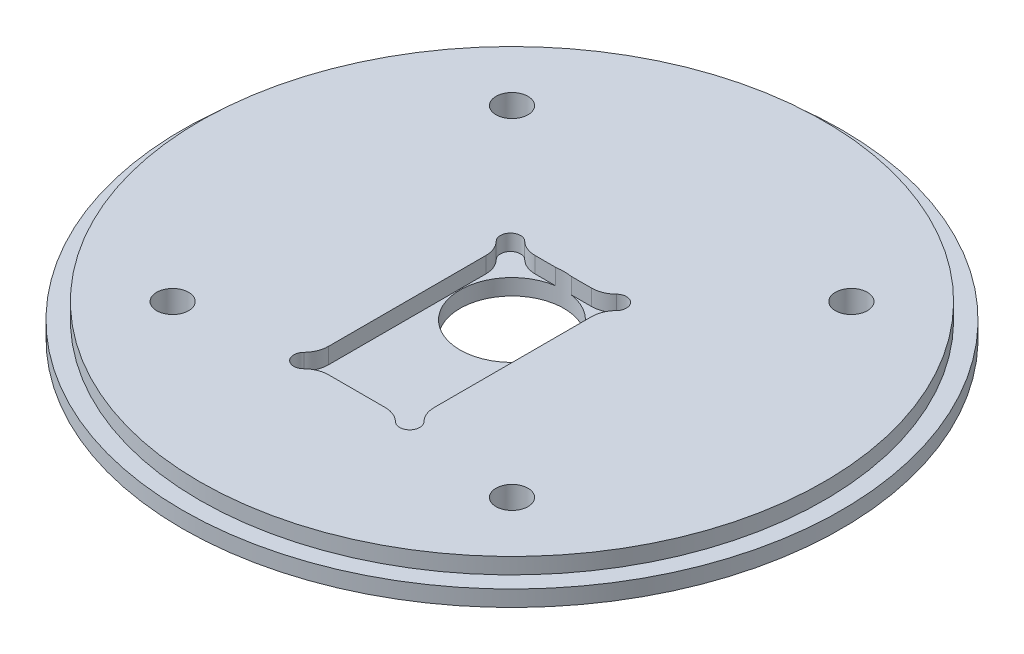
ISO-10303-21;
HEADER;
FILE_DESCRIPTION(('STEP AP214'),'2;1');
FILE_NAME('part.step','',(''),(''),'','','');
FILE_SCHEMA(('AUTOMOTIVE_DESIGN { 1 0 10303 214 1 1 1 1 }'));
ENDSEC;
DATA;
#1=APPLICATION_CONTEXT('core data for automotive mechanical design processes');
#2=APPLICATION_PROTOCOL_DEFINITION('international standard','automotive_design',2000,#1);
#3=PRODUCT_CONTEXT('',#1,'mechanical');
#4=PRODUCT('Part','Part','',(#3));
#5=PRODUCT_RELATED_PRODUCT_CATEGORY('part','',(#4));
#6=PRODUCT_DEFINITION_FORMATION('','',#4);
#7=PRODUCT_DEFINITION_CONTEXT('part definition',#1,'design');
#8=PRODUCT_DEFINITION('design','',#6,#7);
#9=PRODUCT_DEFINITION_SHAPE('','',#8);
#10=(LENGTH_UNIT() NAMED_UNIT(*) SI_UNIT(.MILLI.,.METRE.));
#11=(NAMED_UNIT(*) PLANE_ANGLE_UNIT() SI_UNIT($,.RADIAN.));
#12=(NAMED_UNIT(*) SI_UNIT($,.STERADIAN.) SOLID_ANGLE_UNIT());
#13=UNCERTAINTY_MEASURE_WITH_UNIT(LENGTH_MEASURE(1.E-05),#10,'distance_accuracy_value','');
#14=(GEOMETRIC_REPRESENTATION_CONTEXT(3) GLOBAL_UNCERTAINTY_ASSIGNED_CONTEXT((#13)) GLOBAL_UNIT_ASSIGNED_CONTEXT((#10,
#11,#12)) REPRESENTATION_CONTEXT('',''));
#15=CARTESIAN_POINT('',(0.,0.,0.));
#16=DIRECTION('',(0.,0.,1.));
#17=DIRECTION('',(1.,0.,0.));
#18=AXIS2_PLACEMENT_3D('',#15,#16,#17);
#19=CARTESIAN_POINT('',(-33.6759604540092,6.35,-33.6759604540095));
#20=DIRECTION('',(0.,1.,0.));
#21=DIRECTION('',(0.,0.,1.));
#22=AXIS2_PLACEMENT_3D('',#19,#20,#21);
#23=CYLINDRICAL_SURFACE('',#22,3.175);
#24=CARTESIAN_POINT('',(-33.6759604540092,6.35,-33.6759604540095));
#25=DIRECTION('',(0.,1.,0.));
#26=DIRECTION('',(0.,0.,1.));
#27=AXIS2_PLACEMENT_3D('',#24,#25,#26);
#28=CIRCLE('',#27,3.175);
#29=CARTESIAN_POINT('',(-33.6759604540092,6.35,-30.5009604540095));
#30=VERTEX_POINT('',#29);
#31=EDGE_CURVE('E320',#30,#30,#28,.T.);
#32=ORIENTED_EDGE('',*,*,#31,.T.);
#33=EDGE_LOOP('',(#32));
#34=FACE_BOUND('',#33,.T.);
#35=CARTESIAN_POINT('',(-33.6759604540092,1.5875,-33.6759604540095));
#36=DIRECTION('',(0.,-1.,0.));
#37=DIRECTION('',(0.,0.,-1.));
#38=AXIS2_PLACEMENT_3D('',#35,#36,#37);
#39=CIRCLE('',#38,3.175);
#40=CARTESIAN_POINT('',(-33.6759604540092,1.5875,-36.8509604540095));
#41=VERTEX_POINT('',#40);
#42=EDGE_CURVE('E43',#41,#41,#39,.F.);
#43=ORIENTED_EDGE('',*,*,#42,.F.);
#44=EDGE_LOOP('',(#43));
#45=FACE_BOUND('',#44,.T.);
#46=ADVANCED_FACE('F39',(#34,#45),#23,.F.);
#47=CARTESIAN_POINT('',(33.6759604540091,6.35,33.6759604540095));
#48=DIRECTION('',(0.,1.,0.));
#49=DIRECTION('',(0.,0.,1.));
#50=AXIS2_PLACEMENT_3D('',#47,#48,#49);
#51=CYLINDRICAL_SURFACE('',#50,3.175);
#52=CARTESIAN_POINT('',(33.6759604540091,6.35,33.6759604540095));
#53=DIRECTION('',(0.,1.,0.));
#54=DIRECTION('',(0.,0.,1.));
#55=AXIS2_PLACEMENT_3D('',#52,#53,#54);
#56=CIRCLE('',#55,3.175);
#57=CARTESIAN_POINT('',(33.6759604540091,6.35,36.8509604540095));
#58=VERTEX_POINT('',#57);
#59=EDGE_CURVE('E317',#58,#58,#56,.T.);
#60=ORIENTED_EDGE('',*,*,#59,.T.);
#61=EDGE_LOOP('',(#60));
#62=FACE_BOUND('',#61,.T.);
#63=CARTESIAN_POINT('',(33.6759604540091,1.5875,33.6759604540095));
#64=DIRECTION('',(0.,-1.,0.));
#65=DIRECTION('',(0.,0.,-1.));
#66=AXIS2_PLACEMENT_3D('',#63,#64,#65);
#67=CIRCLE('',#66,3.175);
#68=CARTESIAN_POINT('',(33.6759604540091,1.5875,30.5009604540095));
#69=VERTEX_POINT('',#68);
#70=EDGE_CURVE('E344',#69,#69,#67,.F.);
#71=ORIENTED_EDGE('',*,*,#70,.F.);
#72=EDGE_LOOP('',(#71));
#73=FACE_BOUND('',#72,.T.);
#74=ADVANCED_FACE('F354',(#62,#73),#51,.F.);
#75=CARTESIAN_POINT('',(33.6759604540095,6.35,-33.6759604540092));
#76=DIRECTION('',(0.,1.,0.));
#77=DIRECTION('',(0.,0.,1.));
#78=AXIS2_PLACEMENT_3D('',#75,#76,#77);
#79=CYLINDRICAL_SURFACE('',#78,3.175);
#80=CARTESIAN_POINT('',(33.6759604540095,6.35,-33.6759604540092));
#81=DIRECTION('',(0.,1.,0.));
#82=DIRECTION('',(0.,0.,1.));
#83=AXIS2_PLACEMENT_3D('',#80,#81,#82);
#84=CIRCLE('',#83,3.175);
#85=CARTESIAN_POINT('',(33.6759604540095,6.35,-30.5009604540092));
#86=VERTEX_POINT('',#85);
#87=EDGE_CURVE('E314',#86,#86,#84,.T.);
#88=ORIENTED_EDGE('',*,*,#87,.T.);
#89=EDGE_LOOP('',(#88));
#90=FACE_BOUND('',#89,.T.);
#91=CARTESIAN_POINT('',(33.6759604540095,1.5875,-33.6759604540092));
#92=DIRECTION('',(0.,-1.,0.));
#93=DIRECTION('',(0.,0.,-1.));
#94=AXIS2_PLACEMENT_3D('',#91,#92,#93);
#95=CIRCLE('',#94,3.175);
#96=CARTESIAN_POINT('',(33.6759604540095,1.5875,-36.8509604540092));
#97=VERTEX_POINT('',#96);
#98=EDGE_CURVE('E341',#97,#97,#95,.F.);
#99=ORIENTED_EDGE('',*,*,#98,.F.);
#100=EDGE_LOOP('',(#99));
#101=FACE_BOUND('',#100,.T.);
#102=ADVANCED_FACE('F361',(#90,#101),#79,.F.);
#103=CARTESIAN_POINT('',(-33.6759604540095,6.35,33.6759604540092));
#104=DIRECTION('',(0.,1.,0.));
#105=DIRECTION('',(0.,0.,1.));
#106=AXIS2_PLACEMENT_3D('',#103,#104,#105);
#107=CYLINDRICAL_SURFACE('',#106,3.175);
#108=CARTESIAN_POINT('',(-33.6759604540095,6.35,33.6759604540092));
#109=DIRECTION('',(0.,1.,0.));
#110=DIRECTION('',(0.,0.,1.));
#111=AXIS2_PLACEMENT_3D('',#108,#109,#110);
#112=CIRCLE('',#111,3.175);
#113=CARTESIAN_POINT('',(-33.6759604540095,6.35,36.8509604540092));
#114=VERTEX_POINT('',#113);
#115=EDGE_CURVE('E311',#114,#114,#112,.T.);
#116=ORIENTED_EDGE('',*,*,#115,.T.);
#117=EDGE_LOOP('',(#116));
#118=FACE_BOUND('',#117,.T.);
#119=CARTESIAN_POINT('',(-33.6759604540095,1.5875,33.6759604540092));
#120=DIRECTION('',(0.,-1.,0.));
#121=DIRECTION('',(0.,0.,-1.));
#122=AXIS2_PLACEMENT_3D('',#119,#120,#121);
#123=CIRCLE('',#122,3.175);
#124=CARTESIAN_POINT('',(-33.6759604540095,1.5875,30.5009604540092));
#125=VERTEX_POINT('',#124);
#126=EDGE_CURVE('E338',#125,#125,#123,.F.);
#127=ORIENTED_EDGE('',*,*,#126,.F.);
#128=EDGE_LOOP('',(#127));
#129=FACE_BOUND('',#128,.T.);
#130=ADVANCED_FACE('F386',(#118,#129),#107,.F.);
#131=CARTESIAN_POINT('',(0.,6.35,0.));
#132=DIRECTION('',(0.,-1.,0.));
#133=DIRECTION('',(0.,0.,-1.));
#134=AXIS2_PLACEMENT_3D('',#131,#132,#133);
#135=CYLINDRICAL_SURFACE('',#134,65.405);
#136=CARTESIAN_POINT('',(0.,0.,0.));
#137=DIRECTION('',(0.,1.,0.));
#138=DIRECTION('',(0.,0.,1.));
#139=AXIS2_PLACEMENT_3D('',#136,#137,#138);
#140=CIRCLE('',#139,65.405);
#141=CARTESIAN_POINT('',(0.,0.,65.405));
#142=VERTEX_POINT('',#141);
#143=EDGE_CURVE('E332',#142,#142,#140,.T.);
#144=ORIENTED_EDGE('',*,*,#143,.T.);
#145=EDGE_LOOP('',(#144));
#146=FACE_BOUND('',#145,.T.);
#147=CARTESIAN_POINT('',(0.,3.175,0.));
#148=DIRECTION('',(0.,1.,0.));
#149=DIRECTION('',(0.,0.,1.));
#150=AXIS2_PLACEMENT_3D('',#147,#148,#149);
#151=CIRCLE('',#150,65.405);
#152=CARTESIAN_POINT('',(0.,3.175,65.405));
#153=VERTEX_POINT('',#152);
#154=EDGE_CURVE('E327',#153,#153,#151,.T.);
#155=ORIENTED_EDGE('',*,*,#154,.F.);
#156=EDGE_LOOP('',(#155));
#157=FACE_BOUND('',#156,.T.);
#158=ADVANCED_FACE('F41',(#146,#157),#135,.T.);
#159=CARTESIAN_POINT('',(0.,0.,0.));
#160=DIRECTION('',(0.,1.,0.));
#161=DIRECTION('',(0.,0.,1.));
#162=AXIS2_PLACEMENT_3D('',#159,#160,#161);
#163=PLANE('',#162);
#164=CARTESIAN_POINT('',(-33.6759604540092,0.,-33.6759604540095));
#165=DIRECTION('',(0.,-1.,0.));
#166=DIRECTION('',(0.,0.,-1.));
#167=AXIS2_PLACEMENT_3D('',#164,#165,#166);
#168=CIRCLE('',#167,6.0325);
#169=CARTESIAN_POINT('',(-33.6759604540092,0.,-39.7084604540095));
#170=VERTEX_POINT('',#169);
#171=EDGE_CURVE('E391',#170,#170,#168,.T.);
#172=ORIENTED_EDGE('',*,*,#171,.F.);
#173=EDGE_LOOP('',(#172));
#174=FACE_BOUND('',#173,.T.);
#175=CARTESIAN_POINT('',(33.6759604540095,0.,-33.6759604540092));
#176=DIRECTION('',(0.,-1.,0.));
#177=DIRECTION('',(0.,0.,-1.));
#178=AXIS2_PLACEMENT_3D('',#175,#176,#177);
#179=CIRCLE('',#178,6.0325);
#180=CARTESIAN_POINT('',(33.6759604540095,0.,-39.7084604540092));
#181=VERTEX_POINT('',#180);
#182=EDGE_CURVE('E395',#181,#181,#179,.T.);
#183=ORIENTED_EDGE('',*,*,#182,.F.);
#184=EDGE_LOOP('',(#183));
#185=FACE_BOUND('',#184,.T.);
#186=CARTESIAN_POINT('',(33.6759604540091,0.,33.6759604540095));
#187=DIRECTION('',(0.,-1.,0.));
#188=DIRECTION('',(0.,0.,-1.));
#189=AXIS2_PLACEMENT_3D('',#186,#187,#188);
#190=CIRCLE('',#189,6.03249999999999);
#191=CARTESIAN_POINT('',(33.6759604540091,0.,27.6434604540095));
#192=VERTEX_POINT('',#191);
#193=EDGE_CURVE('E399',#192,#192,#190,.T.);
#194=ORIENTED_EDGE('',*,*,#193,.F.);
#195=EDGE_LOOP('',(#194));
#196=FACE_BOUND('',#195,.T.);
#197=CARTESIAN_POINT('',(-33.6759604540095,0.,33.6759604540092));
#198=DIRECTION('',(0.,-1.,0.));
#199=DIRECTION('',(0.,0.,-1.));
#200=AXIS2_PLACEMENT_3D('',#197,#198,#199);
#201=CIRCLE('',#200,6.0325);
#202=CARTESIAN_POINT('',(-33.6759604540095,0.,27.6434604540092));
#203=VERTEX_POINT('',#202);
#204=EDGE_CURVE('E196',#203,#203,#201,.T.);
#205=ORIENTED_EDGE('',*,*,#204,.F.);
#206=EDGE_LOOP('',(#205));
#207=FACE_BOUND('',#206,.T.);
#208=CARTESIAN_POINT('',(0.,0.,0.));
#209=DIRECTION('',(0.,1.,0.));
#210=DIRECTION('',(0.,0.,1.));
#211=AXIS2_PLACEMENT_3D('',#208,#209,#210);
#212=CIRCLE('',#211,10.31875);
#213=CARTESIAN_POINT('',(0.,0.,10.31875));
#214=VERTEX_POINT('',#213);
#215=EDGE_CURVE('E308',#214,#214,#212,.T.);
#216=ORIENTED_EDGE('',*,*,#215,.T.);
#217=EDGE_LOOP('',(#216));
#218=FACE_BOUND('',#217,.T.);
#219=ORIENTED_EDGE('',*,*,#143,.F.);
#220=EDGE_LOOP('',(#219));
#221=FACE_BOUND('',#220,.T.);
#222=ADVANCED_FACE('F374',(#174,#185,#196,#207,#218,#221),#163,.F.);
#223=CARTESIAN_POINT('',(0.,3.175,0.));
#224=DIRECTION('',(0.,1.,0.));
#225=DIRECTION('',(0.,0.,1.));
#226=AXIS2_PLACEMENT_3D('',#223,#224,#225);
#227=PLANE('',#226);
#228=CARTESIAN_POINT('',(0.,3.175,0.));
#229=DIRECTION('',(0.,1.,0.));
#230=DIRECTION('',(0.,0.,1.));
#231=AXIS2_PLACEMENT_3D('',#228,#229,#230);
#232=CIRCLE('',#231,61.976);
#233=CARTESIAN_POINT('',(0.,3.175,61.976));
#234=VERTEX_POINT('',#233);
#235=EDGE_CURVE('E324',#234,#234,#232,.T.);
#236=ORIENTED_EDGE('',*,*,#235,.F.);
#237=EDGE_LOOP('',(#236));
#238=FACE_BOUND('',#237,.T.);
#239=ORIENTED_EDGE('',*,*,#154,.T.);
#240=EDGE_LOOP('',(#239));
#241=FACE_BOUND('',#240,.T.);
#242=ADVANCED_FACE('F370',(#238,#241),#227,.T.);
#243=CARTESIAN_POINT('',(0.,3.175,0.));
#244=DIRECTION('',(0.,1.,0.));
#245=DIRECTION('',(0.,0.,1.));
#246=AXIS2_PLACEMENT_3D('',#243,#244,#245);
#247=CYLINDRICAL_SURFACE('',#246,61.976);
#248=ORIENTED_EDGE('',*,*,#235,.T.);
#249=EDGE_LOOP('',(#248));
#250=FACE_BOUND('',#249,.T.);
#251=CARTESIAN_POINT('',(0.,6.35,0.));
#252=DIRECTION('',(0.,1.,0.));
#253=DIRECTION('',(0.,0.,1.));
#254=AXIS2_PLACEMENT_3D('',#251,#252,#253);
#255=CIRCLE('',#254,61.976);
#256=CARTESIAN_POINT('',(0.,6.35,61.976));
#257=VERTEX_POINT('',#256);
#258=EDGE_CURVE('E323',#257,#257,#255,.T.);
#259=ORIENTED_EDGE('',*,*,#258,.F.);
#260=EDGE_LOOP('',(#259));
#261=FACE_BOUND('',#260,.T.);
#262=ADVANCED_FACE('F366',(#250,#261),#247,.T.);
#263=CARTESIAN_POINT('',(0.,6.35,0.));
#264=DIRECTION('',(0.,1.,0.));
#265=DIRECTION('',(0.,0.,1.));
#266=AXIS2_PLACEMENT_3D('',#263,#264,#265);
#267=PLANE('',#266);
#268=DIRECTION('',(-1.,0.,0.));
#269=VECTOR('',#268,1.);
#270=CARTESIAN_POINT('',(-5.60102051443364,6.35,-10.2));
#271=LINE('',#270,#269);
#272=CARTESIAN_POINT('',(-1.56096174280472,6.35,-10.2));
#273=VERTEX_POINT('',#272);
#274=CARTESIAN_POINT('',(-5.60102051443364,6.35,-10.2));
#275=VERTEX_POINT('',#274);
#276=EDGE_CURVE('E264',#273,#275,#271,.T.);
#277=ORIENTED_EDGE('',*,*,#276,.F.);
#278=CARTESIAN_POINT('',(0.,6.35,0.));
#279=DIRECTION('',(0.,1.,0.));
#280=DIRECTION('',(0.,0.,1.));
#281=AXIS2_PLACEMENT_3D('',#278,#279,#280);
#282=CIRCLE('',#281,10.31875);
#283=CARTESIAN_POINT('',(1.56096174280472,6.35,-10.2));
#284=VERTEX_POINT('',#283);
#285=EDGE_CURVE('E277',#284,#273,#282,.T.);
#286=ORIENTED_EDGE('',*,*,#285,.F.);
#287=CARTESIAN_POINT('',(5.60102051443364,6.35,-10.2));
#288=VERTEX_POINT('',#287);
#289=EDGE_CURVE('E265',#288,#284,#271,.T.);
#290=ORIENTED_EDGE('',*,*,#289,.F.);
#291=CARTESIAN_POINT('',(5.60102051443364,6.35,-15.2));
#292=DIRECTION('',(0.,-1.,0.));
#293=DIRECTION('',(0.,0.,-1.));
#294=AXIS2_PLACEMENT_3D('',#291,#292,#293);
#295=CIRCLE('',#294,5.);
#296=CARTESIAN_POINT('',(9.10029157555247,6.35,-11.6285714285714));
#297=VERTEX_POINT('',#296);
#298=EDGE_CURVE('E261',#297,#288,#295,.T.);
#299=ORIENTED_EDGE('',*,*,#298,.F.);
#300=CARTESIAN_POINT('',(10.5,6.35,-10.2));
#301=DIRECTION('',(0.,1.,0.));
#302=DIRECTION('',(0.,0.,1.));
#303=AXIS2_PLACEMENT_3D('',#300,#301,#302);
#304=CIRCLE('',#303,2.);
#305=CARTESIAN_POINT('',(11.9285714285714,6.35,-8.80029157555247));
#306=VERTEX_POINT('',#305);
#307=EDGE_CURVE('E258',#306,#297,#304,.T.);
#308=ORIENTED_EDGE('',*,*,#307,.F.);
#309=CARTESIAN_POINT('',(15.5,6.35,-5.30102051443365));
#310=DIRECTION('',(0.,-1.,0.));
#311=DIRECTION('',(0.,0.,1.));
#312=AXIS2_PLACEMENT_3D('',#309,#310,#311);
#313=CIRCLE('',#312,5.);
#314=CARTESIAN_POINT('',(10.5,6.35,-5.30102051443365));
#315=VERTEX_POINT('',#314);
#316=EDGE_CURVE('E255',#315,#306,#313,.T.);
#317=ORIENTED_EDGE('',*,*,#316,.F.);
#318=DIRECTION('',(0.,0.,-1.));
#319=VECTOR('',#318,1.);
#320=CARTESIAN_POINT('',(10.5,6.35,-5.30102051443365));
#321=LINE('',#320,#319);
#322=CARTESIAN_POINT('',(10.5,6.35,25.9010205144336));
#323=VERTEX_POINT('',#322);
#324=EDGE_CURVE('E252',#323,#315,#321,.T.);
#325=ORIENTED_EDGE('',*,*,#324,.F.);
#326=CARTESIAN_POINT('',(15.5,6.35,25.9010205144336));
#327=DIRECTION('',(0.,-1.,0.));
#328=DIRECTION('',(0.,0.,-1.));
#329=AXIS2_PLACEMENT_3D('',#326,#327,#328);
#330=CIRCLE('',#329,5.);
#331=CARTESIAN_POINT('',(11.9285714285714,6.35,29.4002915755525));
#332=VERTEX_POINT('',#331);
#333=EDGE_CURVE('E249',#332,#323,#330,.T.);
#334=ORIENTED_EDGE('',*,*,#333,.F.);
#335=CARTESIAN_POINT('',(10.5,6.35,30.8));
#336=DIRECTION('',(0.,1.,0.));
#337=DIRECTION('',(0.,0.,-1.));
#338=AXIS2_PLACEMENT_3D('',#335,#336,#337);
#339=CIRCLE('',#338,2.);
#340=CARTESIAN_POINT('',(9.10029157555247,6.35,32.2285714285714));
#341=VERTEX_POINT('',#340);
#342=EDGE_CURVE('E246',#341,#332,#339,.T.);
#343=ORIENTED_EDGE('',*,*,#342,.F.);
#344=CARTESIAN_POINT('',(5.60102051443364,6.35,35.8));
#345=DIRECTION('',(0.,-1.,0.));
#346=DIRECTION('',(0.,0.,1.));
#347=AXIS2_PLACEMENT_3D('',#344,#345,#346);
#348=CIRCLE('',#347,5.);
#349=CARTESIAN_POINT('',(5.60102051443364,6.35,30.8));
#350=VERTEX_POINT('',#349);
#351=EDGE_CURVE('E243',#350,#341,#348,.T.);
#352=ORIENTED_EDGE('',*,*,#351,.F.);
#353=DIRECTION('',(1.,0.,0.));
#354=VECTOR('',#353,1.);
#355=CARTESIAN_POINT('',(-5.60102051443364,6.35,30.8));
#356=LINE('',#355,#354);
#357=CARTESIAN_POINT('',(-5.60102051443364,6.35,30.8));
#358=VERTEX_POINT('',#357);
#359=EDGE_CURVE('E240',#358,#350,#356,.T.);
#360=ORIENTED_EDGE('',*,*,#359,.F.);
#361=CARTESIAN_POINT('',(-5.60102051443364,6.35,35.8));
#362=DIRECTION('',(0.,-1.,0.));
#363=DIRECTION('',(0.,0.,-1.));
#364=AXIS2_PLACEMENT_3D('',#361,#362,#363);
#365=CIRCLE('',#364,5.);
#366=CARTESIAN_POINT('',(-9.10029157555246,6.35,32.2285714285714));
#367=VERTEX_POINT('',#366);
#368=EDGE_CURVE('E237',#367,#358,#365,.T.);
#369=ORIENTED_EDGE('',*,*,#368,.F.);
#370=CARTESIAN_POINT('',(-10.5,6.35,30.8));
#371=DIRECTION('',(0.,1.,0.));
#372=DIRECTION('',(0.,0.,1.));
#373=AXIS2_PLACEMENT_3D('',#370,#371,#372);
#374=CIRCLE('',#373,2.);
#375=CARTESIAN_POINT('',(-11.9285714285714,6.35,29.4002915755525));
#376=VERTEX_POINT('',#375);
#377=EDGE_CURVE('E235',#376,#367,#374,.T.);
#378=ORIENTED_EDGE('',*,*,#377,.F.);
#379=CARTESIAN_POINT('',(-15.5,6.35,25.9010205144336));
#380=DIRECTION('',(0.,-1.,0.));
#381=DIRECTION('',(0.,0.,1.));
#382=AXIS2_PLACEMENT_3D('',#379,#380,#381);
#383=CIRCLE('',#382,5.);
#384=CARTESIAN_POINT('',(-10.5,6.35,25.9010205144336));
#385=VERTEX_POINT('',#384);
#386=EDGE_CURVE('E173',#385,#376,#383,.T.);
#387=ORIENTED_EDGE('',*,*,#386,.F.);
#388=DIRECTION('',(0.,0.,1.));
#389=VECTOR('',#388,1.);
#390=CARTESIAN_POINT('',(-10.5,6.35,-5.30102051443365));
#391=LINE('',#390,#389);
#392=CARTESIAN_POINT('',(-10.5,6.35,-5.30102051443365));
#393=VERTEX_POINT('',#392);
#394=EDGE_CURVE('E190',#393,#385,#391,.T.);
#395=ORIENTED_EDGE('',*,*,#394,.F.);
#396=CARTESIAN_POINT('',(-15.5,6.35,-5.30102051443365));
#397=DIRECTION('',(0.,-1.,0.));
#398=DIRECTION('',(0.,0.,-1.));
#399=AXIS2_PLACEMENT_3D('',#396,#397,#398);
#400=CIRCLE('',#399,5.);
#401=CARTESIAN_POINT('',(-11.9285714285714,6.35,-8.80029157555247));
#402=VERTEX_POINT('',#401);
#403=EDGE_CURVE('E193',#402,#393,#400,.T.);
#404=ORIENTED_EDGE('',*,*,#403,.F.);
#405=CARTESIAN_POINT('',(-10.5,6.35,-10.2));
#406=DIRECTION('',(0.,1.,0.));
#407=DIRECTION('',(0.,0.,-1.));
#408=AXIS2_PLACEMENT_3D('',#405,#406,#407);
#409=CIRCLE('',#408,2.);
#410=CARTESIAN_POINT('',(-9.10029157555247,6.35,-11.6285714285714));
#411=VERTEX_POINT('',#410);
#412=EDGE_CURVE('E270',#411,#402,#409,.T.);
#413=ORIENTED_EDGE('',*,*,#412,.F.);
#414=CARTESIAN_POINT('',(-5.60102051443364,6.35,-15.2));
#415=DIRECTION('',(0.,-1.,0.));
#416=DIRECTION('',(0.,0.,1.));
#417=AXIS2_PLACEMENT_3D('',#414,#415,#416);
#418=CIRCLE('',#417,5.);
#419=EDGE_CURVE('E267',#275,#411,#418,.T.);
#420=ORIENTED_EDGE('',*,*,#419,.F.);
#421=EDGE_LOOP('',(#277,#286,#290,#299,#308,#317,#325,#334,#343,#352,#360,#369,#378,#387,#395,
#404,#413,#420));
#422=FACE_BOUND('',#421,.T.);
#423=ORIENTED_EDGE('',*,*,#115,.F.);
#424=EDGE_LOOP('',(#423));
#425=FACE_BOUND('',#424,.T.);
#426=ORIENTED_EDGE('',*,*,#87,.F.);
#427=EDGE_LOOP('',(#426));
#428=FACE_BOUND('',#427,.T.);
#429=ORIENTED_EDGE('',*,*,#59,.F.);
#430=EDGE_LOOP('',(#429));
#431=FACE_BOUND('',#430,.T.);
#432=ORIENTED_EDGE('',*,*,#31,.F.);
#433=EDGE_LOOP('',(#432));
#434=FACE_BOUND('',#433,.T.);
#435=ORIENTED_EDGE('',*,*,#258,.T.);
#436=EDGE_LOOP('',(#435));
#437=FACE_BOUND('',#436,.T.);
#438=ADVANCED_FACE('F369',(#422,#425,#428,#431,#434,#437),#267,.T.);
#439=CARTESIAN_POINT('',(0.,6.35,0.));
#440=DIRECTION('',(0.,1.,0.));
#441=DIRECTION('',(0.,0.,1.));
#442=AXIS2_PLACEMENT_3D('',#439,#440,#441);
#443=CYLINDRICAL_SURFACE('',#442,10.31875);
#444=ORIENTED_EDGE('',*,*,#285,.T.);
#445=DIRECTION('',(0.,1.,0.));
#446=VECTOR('',#445,1.);
#447=CARTESIAN_POINT('',(-1.56096174280472,6.35,-10.2));
#448=LINE('',#447,#446);
#449=CARTESIAN_POINT('',(-1.56096174280472,3.175,-10.2));
#450=VERTEX_POINT('',#449);
#451=EDGE_CURVE('E11',#273,#450,#448,.F.);
#452=ORIENTED_EDGE('',*,*,#451,.T.);
#453=CARTESIAN_POINT('',(0.,3.175,0.));
#454=DIRECTION('',(0.,1.,0.));
#455=DIRECTION('',(0.,0.,1.));
#456=AXIS2_PLACEMENT_3D('',#453,#454,#455);
#457=CIRCLE('',#456,10.31875);
#458=CARTESIAN_POINT('',(1.56096174280472,3.175,-10.2));
#459=VERTEX_POINT('',#458);
#460=EDGE_CURVE('E61',#459,#450,#457,.F.);
#461=ORIENTED_EDGE('',*,*,#460,.F.);
#462=DIRECTION('',(0.,1.,0.));
#463=VECTOR('',#462,1.);
#464=CARTESIAN_POINT('',(1.56096174280472,6.35,-10.2));
#465=LINE('',#464,#463);
#466=EDGE_CURVE('E48',#459,#284,#465,.T.);
#467=ORIENTED_EDGE('',*,*,#466,.T.);
#468=EDGE_LOOP('',(#444,#452,#461,#467));
#469=FACE_BOUND('',#468,.T.);
#470=ORIENTED_EDGE('',*,*,#215,.F.);
#471=EDGE_LOOP('',(#470));
#472=FACE_BOUND('',#471,.T.);
#473=ADVANCED_FACE('F377',(#469,#472),#443,.F.);
#474=CARTESIAN_POINT('',(-5.60102051443364,3.175,-10.2));
#475=DIRECTION('',(0.,0.,-1.));
#476=DIRECTION('',(-1.,0.,0.));
#477=AXIS2_PLACEMENT_3D('',#474,#475,#476);
#478=PLANE('',#477);
#479=ORIENTED_EDGE('',*,*,#276,.T.);
#480=DIRECTION('',(0.,1.,0.));
#481=VECTOR('',#480,1.);
#482=CARTESIAN_POINT('',(-5.60102051443364,3.175,-10.2));
#483=LINE('',#482,#481);
#484=CARTESIAN_POINT('',(-5.60102051443364,3.175,-10.2));
#485=VERTEX_POINT('',#484);
#486=EDGE_CURVE('E284',#485,#275,#483,.T.);
#487=ORIENTED_EDGE('',*,*,#486,.F.);
#488=DIRECTION('',(-1.,0.,0.));
#489=VECTOR('',#488,1.);
#490=CARTESIAN_POINT('',(-5.60102051443364,3.175,-10.2));
#491=LINE('',#490,#489);
#492=EDGE_CURVE('E223',#450,#485,#491,.T.);
#493=ORIENTED_EDGE('',*,*,#492,.F.);
#494=ORIENTED_EDGE('',*,*,#451,.F.);
#495=EDGE_LOOP('',(#479,#487,#493,#494));
#496=FACE_BOUND('',#495,.T.);
#497=ADVANCED_FACE('F411',(#496),#478,.F.);
#498=CARTESIAN_POINT('',(5.60102051443364,3.175,-10.2));
#499=VERTEX_POINT('',#498);
#500=EDGE_CURVE('E56',#499,#459,#491,.T.);
#501=ORIENTED_EDGE('',*,*,#500,.F.);
#502=DIRECTION('',(0.,1.,0.));
#503=VECTOR('',#502,1.);
#504=CARTESIAN_POINT('',(5.60102051443364,3.175,-10.2));
#505=LINE('',#504,#503);
#506=EDGE_CURVE('E287',#499,#288,#505,.T.);
#507=ORIENTED_EDGE('',*,*,#506,.T.);
#508=ORIENTED_EDGE('',*,*,#289,.T.);
#509=ORIENTED_EDGE('',*,*,#466,.F.);
#510=EDGE_LOOP('',(#501,#507,#508,#509));
#511=FACE_BOUND('',#510,.T.);
#512=ADVANCED_FACE('F417',(#511),#478,.F.);
#513=CARTESIAN_POINT('',(-15.5,3.175,25.9010205144336));
#514=DIRECTION('',(0.,1.,0.));
#515=DIRECTION('',(0.,0.,1.));
#516=AXIS2_PLACEMENT_3D('',#513,#514,#515);
#517=PLANE('',#516);
#518=ORIENTED_EDGE('',*,*,#460,.T.);
#519=ORIENTED_EDGE('',*,*,#492,.T.);
#520=CARTESIAN_POINT('',(-5.60102051443364,3.175,-15.2));
#521=DIRECTION('',(0.,-1.,0.));
#522=DIRECTION('',(0.,0.,1.));
#523=AXIS2_PLACEMENT_3D('',#520,#521,#522);
#524=CIRCLE('',#523,5.);
#525=CARTESIAN_POINT('',(-9.10029157555247,3.175,-11.6285714285714));
#526=VERTEX_POINT('',#525);
#527=EDGE_CURVE('E225',#485,#526,#524,.T.);
#528=ORIENTED_EDGE('',*,*,#527,.T.);
#529=CARTESIAN_POINT('',(-10.5,3.175,-10.2));
#530=DIRECTION('',(0.,1.,0.));
#531=DIRECTION('',(0.,0.,-1.));
#532=AXIS2_PLACEMENT_3D('',#529,#530,#531);
#533=CIRCLE('',#532,2.);
#534=CARTESIAN_POINT('',(-11.9285714285714,3.175,-8.80029157555247));
#535=VERTEX_POINT('',#534);
#536=EDGE_CURVE('E228',#526,#535,#533,.T.);
#537=ORIENTED_EDGE('',*,*,#536,.T.);
#538=CARTESIAN_POINT('',(-15.5,3.175,-5.30102051443365));
#539=DIRECTION('',(0.,-1.,0.));
#540=DIRECTION('',(0.,0.,-1.));
#541=AXIS2_PLACEMENT_3D('',#538,#539,#540);
#542=CIRCLE('',#541,5.);
#543=CARTESIAN_POINT('',(-10.5,3.175,-5.30102051443365));
#544=VERTEX_POINT('',#543);
#545=EDGE_CURVE('E231',#535,#544,#542,.T.);
#546=ORIENTED_EDGE('',*,*,#545,.T.);
#547=DIRECTION('',(0.,0.,1.));
#548=VECTOR('',#547,1.);
#549=CARTESIAN_POINT('',(-10.5,3.175,-5.30102051443365));
#550=LINE('',#549,#548);
#551=CARTESIAN_POINT('',(-10.5,3.175,25.9010205144336));
#552=VERTEX_POINT('',#551);
#553=EDGE_CURVE('E178',#544,#552,#550,.T.);
#554=ORIENTED_EDGE('',*,*,#553,.T.);
#555=CARTESIAN_POINT('',(-15.5,3.175,25.9010205144336));
#556=DIRECTION('',(0.,-1.,0.));
#557=DIRECTION('',(0.,0.,1.));
#558=AXIS2_PLACEMENT_3D('',#555,#556,#557);
#559=CIRCLE('',#558,5.);
#560=CARTESIAN_POINT('',(-11.9285714285714,3.175,29.4002915755525));
#561=VERTEX_POINT('',#560);
#562=EDGE_CURVE('E170',#552,#561,#559,.T.);
#563=ORIENTED_EDGE('',*,*,#562,.T.);
#564=CARTESIAN_POINT('',(-10.5,3.175,30.8));
#565=DIRECTION('',(0.,1.,0.));
#566=DIRECTION('',(0.,0.,1.));
#567=AXIS2_PLACEMENT_3D('',#564,#565,#566);
#568=CIRCLE('',#567,2.);
#569=CARTESIAN_POINT('',(-9.10029157555246,3.175,32.2285714285714));
#570=VERTEX_POINT('',#569);
#571=EDGE_CURVE('E181',#561,#570,#568,.T.);
#572=ORIENTED_EDGE('',*,*,#571,.T.);
#573=CARTESIAN_POINT('',(-5.60102051443364,3.175,35.8));
#574=DIRECTION('',(0.,-1.,0.));
#575=DIRECTION('',(0.,0.,-1.));
#576=AXIS2_PLACEMENT_3D('',#573,#574,#575);
#577=CIRCLE('',#576,5.);
#578=CARTESIAN_POINT('',(-5.60102051443364,3.175,30.8));
#579=VERTEX_POINT('',#578);
#580=EDGE_CURVE('E185',#570,#579,#577,.T.);
#581=ORIENTED_EDGE('',*,*,#580,.T.);
#582=DIRECTION('',(1.,0.,0.));
#583=VECTOR('',#582,1.);
#584=CARTESIAN_POINT('',(-5.60102051443364,3.175,30.8));
#585=LINE('',#584,#583);
#586=CARTESIAN_POINT('',(5.60102051443364,3.175,30.8));
#587=VERTEX_POINT('',#586);
#588=EDGE_CURVE('E200',#579,#587,#585,.T.);
#589=ORIENTED_EDGE('',*,*,#588,.T.);
#590=CARTESIAN_POINT('',(5.60102051443364,3.175,35.8));
#591=DIRECTION('',(0.,-1.,0.));
#592=DIRECTION('',(0.,0.,1.));
#593=AXIS2_PLACEMENT_3D('',#590,#591,#592);
#594=CIRCLE('',#593,5.);
#595=CARTESIAN_POINT('',(9.10029157555247,3.175,32.2285714285714));
#596=VERTEX_POINT('',#595);
#597=EDGE_CURVE('E203',#587,#596,#594,.T.);
#598=ORIENTED_EDGE('',*,*,#597,.T.);
#599=CARTESIAN_POINT('',(10.5,3.175,30.8));
#600=DIRECTION('',(0.,1.,0.));
#601=DIRECTION('',(0.,0.,-1.));
#602=AXIS2_PLACEMENT_3D('',#599,#600,#601);
#603=CIRCLE('',#602,2.);
#604=CARTESIAN_POINT('',(11.9285714285714,3.175,29.4002915755525));
#605=VERTEX_POINT('',#604);
#606=EDGE_CURVE('E206',#596,#605,#603,.T.);
#607=ORIENTED_EDGE('',*,*,#606,.T.);
#608=CARTESIAN_POINT('',(15.5,3.175,25.9010205144336));
#609=DIRECTION('',(0.,-1.,0.));
#610=DIRECTION('',(0.,0.,-1.));
#611=AXIS2_PLACEMENT_3D('',#608,#609,#610);
#612=CIRCLE('',#611,5.);
#613=CARTESIAN_POINT('',(10.5,3.175,25.9010205144336));
#614=VERTEX_POINT('',#613);
#615=EDGE_CURVE('E209',#605,#614,#612,.T.);
#616=ORIENTED_EDGE('',*,*,#615,.T.);
#617=DIRECTION('',(0.,0.,-1.));
#618=VECTOR('',#617,1.);
#619=CARTESIAN_POINT('',(10.5,3.175,-5.30102051443365));
#620=LINE('',#619,#618);
#621=CARTESIAN_POINT('',(10.5,3.175,-5.30102051443365));
#622=VERTEX_POINT('',#621);
#623=EDGE_CURVE('E212',#614,#622,#620,.T.);
#624=ORIENTED_EDGE('',*,*,#623,.T.);
#625=CARTESIAN_POINT('',(15.5,3.175,-5.30102051443365));
#626=DIRECTION('',(0.,-1.,0.));
#627=DIRECTION('',(0.,0.,1.));
#628=AXIS2_PLACEMENT_3D('',#625,#626,#627);
#629=CIRCLE('',#628,5.);
#630=CARTESIAN_POINT('',(11.9285714285714,3.175,-8.80029157555247));
#631=VERTEX_POINT('',#630);
#632=EDGE_CURVE('E215',#622,#631,#629,.T.);
#633=ORIENTED_EDGE('',*,*,#632,.T.);
#634=CARTESIAN_POINT('',(10.5,3.175,-10.2));
#635=DIRECTION('',(0.,1.,0.));
#636=DIRECTION('',(0.,0.,1.));
#637=AXIS2_PLACEMENT_3D('',#634,#635,#636);
#638=CIRCLE('',#637,2.);
#639=CARTESIAN_POINT('',(9.10029157555247,3.175,-11.6285714285714));
#640=VERTEX_POINT('',#639);
#641=EDGE_CURVE('E218',#631,#640,#638,.T.);
#642=ORIENTED_EDGE('',*,*,#641,.T.);
#643=CARTESIAN_POINT('',(5.60102051443364,3.175,-15.2));
#644=DIRECTION('',(0.,-1.,0.));
#645=DIRECTION('',(0.,0.,-1.));
#646=AXIS2_PLACEMENT_3D('',#643,#644,#645);
#647=CIRCLE('',#646,5.);
#648=EDGE_CURVE('E221',#640,#499,#647,.T.);
#649=ORIENTED_EDGE('',*,*,#648,.T.);
#650=ORIENTED_EDGE('',*,*,#500,.T.);
#651=EDGE_LOOP('',(#518,#519,#528,#537,#546,#554,#563,#572,#581,#589,#598,#607,#616,#624,#633,
#642,#649,#650));
#652=FACE_BOUND('',#651,.T.);
#653=ADVANCED_FACE('F187',(#652),#517,.T.);
#654=CARTESIAN_POINT('',(-15.5,3.175,25.9010205144336));
#655=DIRECTION('',(0.,1.,0.));
#656=DIRECTION('',(0.,0.,1.));
#657=AXIS2_PLACEMENT_3D('',#654,#655,#656);
#658=CYLINDRICAL_SURFACE('',#657,5.);
#659=ORIENTED_EDGE('',*,*,#386,.T.);
#660=DIRECTION('',(0.,1.,0.));
#661=VECTOR('',#660,1.);
#662=CARTESIAN_POINT('',(-11.9285714285714,3.175,29.4002915755525));
#663=LINE('',#662,#661);
#664=EDGE_CURVE('E166',#561,#376,#663,.T.);
#665=ORIENTED_EDGE('',*,*,#664,.F.);
#666=ORIENTED_EDGE('',*,*,#562,.F.);
#667=DIRECTION('',(0.,1.,0.));
#668=VECTOR('',#667,1.);
#669=CARTESIAN_POINT('',(-10.5,3.175,25.9010205144336));
#670=LINE('',#669,#668);
#671=EDGE_CURVE('E275',#552,#385,#670,.T.);
#672=ORIENTED_EDGE('',*,*,#671,.T.);
#673=EDGE_LOOP('',(#659,#665,#666,#672));
#674=FACE_BOUND('',#673,.T.);
#675=ADVANCED_FACE('F168',(#674),#658,.T.);
#676=CARTESIAN_POINT('',(-10.5,3.175,-5.30102051443365));
#677=DIRECTION('',(-1.,0.,0.));
#678=DIRECTION('',(0.,0.,1.));
#679=AXIS2_PLACEMENT_3D('',#676,#677,#678);
#680=PLANE('',#679);
#681=ORIENTED_EDGE('',*,*,#394,.T.);
#682=ORIENTED_EDGE('',*,*,#671,.F.);
#683=ORIENTED_EDGE('',*,*,#553,.F.);
#684=DIRECTION('',(0.,1.,0.));
#685=VECTOR('',#684,1.);
#686=CARTESIAN_POINT('',(-10.5,3.175,-5.30102051443365));
#687=LINE('',#686,#685);
#688=EDGE_CURVE('E278',#544,#393,#687,.T.);
#689=ORIENTED_EDGE('',*,*,#688,.T.);
#690=EDGE_LOOP('',(#681,#682,#683,#689));
#691=FACE_BOUND('',#690,.T.);
#692=ADVANCED_FACE('F463',(#691),#680,.F.);
#693=CARTESIAN_POINT('',(-15.5,3.175,-5.30102051443365));
#694=DIRECTION('',(0.,1.,0.));
#695=DIRECTION('',(0.,0.,1.));
#696=AXIS2_PLACEMENT_3D('',#693,#694,#695);
#697=CYLINDRICAL_SURFACE('',#696,5.);
#698=ORIENTED_EDGE('',*,*,#403,.T.);
#699=ORIENTED_EDGE('',*,*,#688,.F.);
#700=ORIENTED_EDGE('',*,*,#545,.F.);
#701=DIRECTION('',(0.,1.,0.));
#702=VECTOR('',#701,1.);
#703=CARTESIAN_POINT('',(-11.9285714285714,3.175,-8.80029157555247));
#704=LINE('',#703,#702);
#705=EDGE_CURVE('E280',#535,#402,#704,.T.);
#706=ORIENTED_EDGE('',*,*,#705,.T.);
#707=EDGE_LOOP('',(#698,#699,#700,#706));
#708=FACE_BOUND('',#707,.T.);
#709=ADVANCED_FACE('F466',(#708),#697,.T.);
#710=CARTESIAN_POINT('',(-10.5,3.175,-10.2));
#711=DIRECTION('',(0.,1.,0.));
#712=DIRECTION('',(0.,0.,1.));
#713=AXIS2_PLACEMENT_3D('',#710,#711,#712);
#714=CYLINDRICAL_SURFACE('',#713,2.);
#715=ORIENTED_EDGE('',*,*,#412,.T.);
#716=ORIENTED_EDGE('',*,*,#705,.F.);
#717=ORIENTED_EDGE('',*,*,#536,.F.);
#718=DIRECTION('',(0.,1.,0.));
#719=VECTOR('',#718,1.);
#720=CARTESIAN_POINT('',(-9.10029157555247,3.175,-11.6285714285714));
#721=LINE('',#720,#719);
#722=EDGE_CURVE('E282',#526,#411,#721,.T.);
#723=ORIENTED_EDGE('',*,*,#722,.T.);
#724=EDGE_LOOP('',(#715,#716,#717,#723));
#725=FACE_BOUND('',#724,.T.);
#726=ADVANCED_FACE('F470',(#725),#714,.F.);
#727=CARTESIAN_POINT('',(-5.60102051443364,3.175,-15.2));
#728=DIRECTION('',(0.,1.,0.));
#729=DIRECTION('',(0.,0.,1.));
#730=AXIS2_PLACEMENT_3D('',#727,#728,#729);
#731=CYLINDRICAL_SURFACE('',#730,5.);
#732=ORIENTED_EDGE('',*,*,#419,.T.);
#733=ORIENTED_EDGE('',*,*,#722,.F.);
#734=ORIENTED_EDGE('',*,*,#527,.F.);
#735=ORIENTED_EDGE('',*,*,#486,.T.);
#736=EDGE_LOOP('',(#732,#733,#734,#735));
#737=FACE_BOUND('',#736,.T.);
#738=ADVANCED_FACE('F474',(#737),#731,.T.);
#739=CARTESIAN_POINT('',(5.60102051443364,3.175,-15.2));
#740=DIRECTION('',(0.,1.,0.));
#741=DIRECTION('',(0.,0.,1.));
#742=AXIS2_PLACEMENT_3D('',#739,#740,#741);
#743=CYLINDRICAL_SURFACE('',#742,5.);
#744=ORIENTED_EDGE('',*,*,#298,.T.);
#745=ORIENTED_EDGE('',*,*,#506,.F.);
#746=ORIENTED_EDGE('',*,*,#648,.F.);
#747=DIRECTION('',(0.,1.,0.));
#748=VECTOR('',#747,1.);
#749=CARTESIAN_POINT('',(9.10029157555247,3.175,-11.6285714285714));
#750=LINE('',#749,#748);
#751=EDGE_CURVE('E289',#640,#297,#750,.T.);
#752=ORIENTED_EDGE('',*,*,#751,.T.);
#753=EDGE_LOOP('',(#744,#745,#746,#752));
#754=FACE_BOUND('',#753,.T.);
#755=ADVANCED_FACE('F477',(#754),#743,.T.);
#756=CARTESIAN_POINT('',(10.5,3.175,-10.2));
#757=DIRECTION('',(0.,1.,0.));
#758=DIRECTION('',(0.,0.,1.));
#759=AXIS2_PLACEMENT_3D('',#756,#757,#758);
#760=CYLINDRICAL_SURFACE('',#759,2.);
#761=ORIENTED_EDGE('',*,*,#307,.T.);
#762=ORIENTED_EDGE('',*,*,#751,.F.);
#763=ORIENTED_EDGE('',*,*,#641,.F.);
#764=DIRECTION('',(0.,1.,0.));
#765=VECTOR('',#764,1.);
#766=CARTESIAN_POINT('',(11.9285714285714,3.175,-8.80029157555247));
#767=LINE('',#766,#765);
#768=EDGE_CURVE('E291',#631,#306,#767,.T.);
#769=ORIENTED_EDGE('',*,*,#768,.T.);
#770=EDGE_LOOP('',(#761,#762,#763,#769));
#771=FACE_BOUND('',#770,.T.);
#772=ADVANCED_FACE('F482',(#771),#760,.F.);
#773=CARTESIAN_POINT('',(15.5,3.175,-5.30102051443365));
#774=DIRECTION('',(0.,1.,0.));
#775=DIRECTION('',(0.,0.,1.));
#776=AXIS2_PLACEMENT_3D('',#773,#774,#775);
#777=CYLINDRICAL_SURFACE('',#776,5.);
#778=ORIENTED_EDGE('',*,*,#316,.T.);
#779=ORIENTED_EDGE('',*,*,#768,.F.);
#780=ORIENTED_EDGE('',*,*,#632,.F.);
#781=DIRECTION('',(0.,1.,0.));
#782=VECTOR('',#781,1.);
#783=CARTESIAN_POINT('',(10.5,3.175,-5.30102051443365));
#784=LINE('',#783,#782);
#785=EDGE_CURVE('E293',#622,#315,#784,.T.);
#786=ORIENTED_EDGE('',*,*,#785,.T.);
#787=EDGE_LOOP('',(#778,#779,#780,#786));
#788=FACE_BOUND('',#787,.T.);
#789=ADVANCED_FACE('F486',(#788),#777,.T.);
#790=CARTESIAN_POINT('',(10.5,3.175,-5.30102051443365));
#791=DIRECTION('',(1.,0.,0.));
#792=DIRECTION('',(0.,0.,-1.));
#793=AXIS2_PLACEMENT_3D('',#790,#791,#792);
#794=PLANE('',#793);
#795=ORIENTED_EDGE('',*,*,#324,.T.);
#796=ORIENTED_EDGE('',*,*,#785,.F.);
#797=ORIENTED_EDGE('',*,*,#623,.F.);
#798=DIRECTION('',(0.,1.,0.));
#799=VECTOR('',#798,1.);
#800=CARTESIAN_POINT('',(10.5,3.175,25.9010205144336));
#801=LINE('',#800,#799);
#802=EDGE_CURVE('E295',#614,#323,#801,.T.);
#803=ORIENTED_EDGE('',*,*,#802,.T.);
#804=EDGE_LOOP('',(#795,#796,#797,#803));
#805=FACE_BOUND('',#804,.T.);
#806=ADVANCED_FACE('F490',(#805),#794,.F.);
#807=CARTESIAN_POINT('',(15.5,3.175,25.9010205144336));
#808=DIRECTION('',(0.,1.,0.));
#809=DIRECTION('',(0.,0.,1.));
#810=AXIS2_PLACEMENT_3D('',#807,#808,#809);
#811=CYLINDRICAL_SURFACE('',#810,5.);
#812=ORIENTED_EDGE('',*,*,#333,.T.);
#813=ORIENTED_EDGE('',*,*,#802,.F.);
#814=ORIENTED_EDGE('',*,*,#615,.F.);
#815=DIRECTION('',(0.,1.,0.));
#816=VECTOR('',#815,1.);
#817=CARTESIAN_POINT('',(11.9285714285714,3.175,29.4002915755525));
#818=LINE('',#817,#816);
#819=EDGE_CURVE('E297',#605,#332,#818,.T.);
#820=ORIENTED_EDGE('',*,*,#819,.T.);
#821=EDGE_LOOP('',(#812,#813,#814,#820));
#822=FACE_BOUND('',#821,.T.);
#823=ADVANCED_FACE('F494',(#822),#811,.T.);
#824=CARTESIAN_POINT('',(10.5,3.175,30.8));
#825=DIRECTION('',(0.,1.,0.));
#826=DIRECTION('',(0.,0.,1.));
#827=AXIS2_PLACEMENT_3D('',#824,#825,#826);
#828=CYLINDRICAL_SURFACE('',#827,2.);
#829=ORIENTED_EDGE('',*,*,#342,.T.);
#830=ORIENTED_EDGE('',*,*,#819,.F.);
#831=ORIENTED_EDGE('',*,*,#606,.F.);
#832=DIRECTION('',(0.,1.,0.));
#833=VECTOR('',#832,1.);
#834=CARTESIAN_POINT('',(9.10029157555247,3.175,32.2285714285714));
#835=LINE('',#834,#833);
#836=EDGE_CURVE('E299',#596,#341,#835,.T.);
#837=ORIENTED_EDGE('',*,*,#836,.T.);
#838=EDGE_LOOP('',(#829,#830,#831,#837));
#839=FACE_BOUND('',#838,.T.);
#840=ADVANCED_FACE('F498',(#839),#828,.F.);
#841=CARTESIAN_POINT('',(5.60102051443364,3.175,35.8));
#842=DIRECTION('',(0.,1.,0.));
#843=DIRECTION('',(0.,0.,1.));
#844=AXIS2_PLACEMENT_3D('',#841,#842,#843);
#845=CYLINDRICAL_SURFACE('',#844,5.);
#846=ORIENTED_EDGE('',*,*,#351,.T.);
#847=ORIENTED_EDGE('',*,*,#836,.F.);
#848=ORIENTED_EDGE('',*,*,#597,.F.);
#849=DIRECTION('',(0.,1.,0.));
#850=VECTOR('',#849,1.);
#851=CARTESIAN_POINT('',(5.60102051443364,3.175,30.8));
#852=LINE('',#851,#850);
#853=EDGE_CURVE('E301',#587,#350,#852,.T.);
#854=ORIENTED_EDGE('',*,*,#853,.T.);
#855=EDGE_LOOP('',(#846,#847,#848,#854));
#856=FACE_BOUND('',#855,.T.);
#857=ADVANCED_FACE('F502',(#856),#845,.T.);
#858=CARTESIAN_POINT('',(-5.60102051443364,3.175,30.8));
#859=DIRECTION('',(0.,0.,1.));
#860=DIRECTION('',(1.,0.,0.));
#861=AXIS2_PLACEMENT_3D('',#858,#859,#860);
#862=PLANE('',#861);
#863=ORIENTED_EDGE('',*,*,#359,.T.);
#864=ORIENTED_EDGE('',*,*,#853,.F.);
#865=ORIENTED_EDGE('',*,*,#588,.F.);
#866=DIRECTION('',(0.,1.,0.));
#867=VECTOR('',#866,1.);
#868=CARTESIAN_POINT('',(-5.60102051443364,3.175,30.8));
#869=LINE('',#868,#867);
#870=EDGE_CURVE('E303',#579,#358,#869,.T.);
#871=ORIENTED_EDGE('',*,*,#870,.T.);
#872=EDGE_LOOP('',(#863,#864,#865,#871));
#873=FACE_BOUND('',#872,.T.);
#874=ADVANCED_FACE('F506',(#873),#862,.F.);
#875=CARTESIAN_POINT('',(-5.60102051443364,3.175,35.8));
#876=DIRECTION('',(0.,1.,0.));
#877=DIRECTION('',(0.,0.,1.));
#878=AXIS2_PLACEMENT_3D('',#875,#876,#877);
#879=CYLINDRICAL_SURFACE('',#878,5.);
#880=ORIENTED_EDGE('',*,*,#368,.T.);
#881=ORIENTED_EDGE('',*,*,#870,.F.);
#882=ORIENTED_EDGE('',*,*,#580,.F.);
#883=DIRECTION('',(0.,1.,0.));
#884=VECTOR('',#883,1.);
#885=CARTESIAN_POINT('',(-9.10029157555246,3.175,32.2285714285714));
#886=LINE('',#885,#884);
#887=EDGE_CURVE('E177',#570,#367,#886,.T.);
#888=ORIENTED_EDGE('',*,*,#887,.T.);
#889=EDGE_LOOP('',(#880,#881,#882,#888));
#890=FACE_BOUND('',#889,.T.);
#891=ADVANCED_FACE('F510',(#890),#879,.T.);
#892=CARTESIAN_POINT('',(-10.5,3.175,30.8));
#893=DIRECTION('',(0.,1.,0.));
#894=DIRECTION('',(0.,0.,1.));
#895=AXIS2_PLACEMENT_3D('',#892,#893,#894);
#896=CYLINDRICAL_SURFACE('',#895,2.);
#897=ORIENTED_EDGE('',*,*,#377,.T.);
#898=ORIENTED_EDGE('',*,*,#887,.F.);
#899=ORIENTED_EDGE('',*,*,#571,.F.);
#900=ORIENTED_EDGE('',*,*,#664,.T.);
#901=EDGE_LOOP('',(#897,#898,#899,#900));
#902=FACE_BOUND('',#901,.T.);
#903=ADVANCED_FACE('F182',(#902),#896,.F.);
#904=CARTESIAN_POINT('',(-33.6759604540095,1.5875,33.6759604540092));
#905=DIRECTION('',(0.,-1.,0.));
#906=DIRECTION('',(0.,0.,-1.));
#907=AXIS2_PLACEMENT_3D('',#904,#905,#906);
#908=PLANE('',#907);
#909=CARTESIAN_POINT('',(-33.6759604540095,1.5875,33.6759604540092));
#910=DIRECTION('',(0.,-1.,0.));
#911=DIRECTION('',(0.,0.,-1.));
#912=AXIS2_PLACEMENT_3D('',#909,#910,#911);
#913=CIRCLE('',#912,6.0325);
#914=CARTESIAN_POINT('',(-33.6759604540095,1.5875,27.6434604540092));
#915=VERTEX_POINT('',#914);
#916=EDGE_CURVE('E342',#915,#915,#913,.T.);
#917=ORIENTED_EDGE('',*,*,#916,.T.);
#918=EDGE_LOOP('',(#917));
#919=FACE_BOUND('',#918,.T.);
#920=ORIENTED_EDGE('',*,*,#126,.T.);
#921=EDGE_LOOP('',(#920));
#922=FACE_BOUND('',#921,.T.);
#923=ADVANCED_FACE('F445',(#919,#922),#908,.T.);
#924=CARTESIAN_POINT('',(-33.6759604540095,1.5875,33.6759604540092));
#925=DIRECTION('',(0.,-1.,0.));
#926=DIRECTION('',(0.,0.,-1.));
#927=AXIS2_PLACEMENT_3D('',#924,#925,#926);
#928=CYLINDRICAL_SURFACE('',#927,6.0325);
#929=ORIENTED_EDGE('',*,*,#916,.F.);
#930=EDGE_LOOP('',(#929));
#931=FACE_BOUND('',#930,.T.);
#932=ORIENTED_EDGE('',*,*,#204,.T.);
#933=EDGE_LOOP('',(#932));
#934=FACE_BOUND('',#933,.T.);
#935=ADVANCED_FACE('F435',(#931,#934),#928,.F.);
#936=CARTESIAN_POINT('',(33.6759604540095,1.5875,-33.6759604540092));
#937=DIRECTION('',(0.,-1.,0.));
#938=DIRECTION('',(0.,0.,-1.));
#939=AXIS2_PLACEMENT_3D('',#936,#937,#938);
#940=PLANE('',#939);
#941=CARTESIAN_POINT('',(33.6759604540095,1.5875,-33.6759604540092));
#942=DIRECTION('',(0.,-1.,0.));
#943=DIRECTION('',(0.,0.,-1.));
#944=AXIS2_PLACEMENT_3D('',#941,#942,#943);
#945=CIRCLE('',#944,6.0325);
#946=CARTESIAN_POINT('',(33.6759604540095,1.5875,-39.7084604540092));
#947=VERTEX_POINT('',#946);
#948=EDGE_CURVE('E734',#947,#947,#945,.T.);
#949=ORIENTED_EDGE('',*,*,#948,.T.);
#950=EDGE_LOOP('',(#949));
#951=FACE_BOUND('',#950,.T.);
#952=ORIENTED_EDGE('',*,*,#98,.T.);
#953=EDGE_LOOP('',(#952));
#954=FACE_BOUND('',#953,.T.);
#955=ADVANCED_FACE('F432',(#951,#954),#940,.T.);
#956=CARTESIAN_POINT('',(33.6759604540095,1.5875,-33.6759604540092));
#957=DIRECTION('',(0.,-1.,0.));
#958=DIRECTION('',(0.,0.,-1.));
#959=AXIS2_PLACEMENT_3D('',#956,#957,#958);
#960=CYLINDRICAL_SURFACE('',#959,6.0325);
#961=ORIENTED_EDGE('',*,*,#948,.F.);
#962=EDGE_LOOP('',(#961));
#963=FACE_BOUND('',#962,.T.);
#964=ORIENTED_EDGE('',*,*,#182,.T.);
#965=EDGE_LOOP('',(#964));
#966=FACE_BOUND('',#965,.T.);
#967=ADVANCED_FACE('F434',(#963,#966),#960,.F.);
#968=CARTESIAN_POINT('',(33.6759604540091,1.5875,33.6759604540095));
#969=DIRECTION('',(0.,-1.,0.));
#970=DIRECTION('',(0.,0.,-1.));
#971=AXIS2_PLACEMENT_3D('',#968,#969,#970);
#972=PLANE('',#971);
#973=CARTESIAN_POINT('',(33.6759604540091,1.5875,33.6759604540095));
#974=DIRECTION('',(0.,-1.,0.));
#975=DIRECTION('',(0.,0.,-1.));
#976=AXIS2_PLACEMENT_3D('',#973,#974,#975);
#977=CIRCLE('',#976,6.03249999999999);
#978=CARTESIAN_POINT('',(33.6759604540091,1.5875,27.6434604540095));
#979=VERTEX_POINT('',#978);
#980=EDGE_CURVE('E729',#979,#979,#977,.T.);
#981=ORIENTED_EDGE('',*,*,#980,.T.);
#982=EDGE_LOOP('',(#981));
#983=FACE_BOUND('',#982,.T.);
#984=ORIENTED_EDGE('',*,*,#70,.T.);
#985=EDGE_LOOP('',(#984));
#986=FACE_BOUND('',#985,.T.);
#987=ADVANCED_FACE('F442',(#983,#986),#972,.T.);
#988=CARTESIAN_POINT('',(33.6759604540091,1.5875,33.6759604540095));
#989=DIRECTION('',(0.,-1.,0.));
#990=DIRECTION('',(0.,0.,-1.));
#991=AXIS2_PLACEMENT_3D('',#988,#989,#990);
#992=CYLINDRICAL_SURFACE('',#991,6.03249999999999);
#993=ORIENTED_EDGE('',*,*,#980,.F.);
#994=EDGE_LOOP('',(#993));
#995=FACE_BOUND('',#994,.T.);
#996=ORIENTED_EDGE('',*,*,#193,.T.);
#997=EDGE_LOOP('',(#996));
#998=FACE_BOUND('',#997,.T.);
#999=ADVANCED_FACE('F457',(#995,#998),#992,.F.);
#1000=CARTESIAN_POINT('',(-33.6759604540092,1.5875,-33.6759604540095));
#1001=DIRECTION('',(0.,-1.,0.));
#1002=DIRECTION('',(0.,0.,-1.));
#1003=AXIS2_PLACEMENT_3D('',#1000,#1001,#1002);
#1004=PLANE('',#1003);
#1005=CARTESIAN_POINT('',(-33.6759604540092,1.5875,-33.6759604540095));
#1006=DIRECTION('',(0.,-1.,0.));
#1007=DIRECTION('',(0.,0.,-1.));
#1008=AXIS2_PLACEMENT_3D('',#1005,#1006,#1007);
#1009=CIRCLE('',#1008,6.0325);
#1010=CARTESIAN_POINT('',(-33.6759604540092,1.5875,-39.7084604540095));
#1011=VERTEX_POINT('',#1010);
#1012=EDGE_CURVE('E737',#1011,#1011,#1009,.T.);
#1013=ORIENTED_EDGE('',*,*,#1012,.T.);
#1014=EDGE_LOOP('',(#1013));
#1015=FACE_BOUND('',#1014,.T.);
#1016=ORIENTED_EDGE('',*,*,#42,.T.);
#1017=EDGE_LOOP('',(#1016));
#1018=FACE_BOUND('',#1017,.T.);
#1019=ADVANCED_FACE('F351',(#1015,#1018),#1004,.T.);
#1020=CARTESIAN_POINT('',(-33.6759604540092,1.5875,-33.6759604540095));
#1021=DIRECTION('',(0.,-1.,0.));
#1022=DIRECTION('',(0.,0.,-1.));
#1023=AXIS2_PLACEMENT_3D('',#1020,#1021,#1022);
#1024=CYLINDRICAL_SURFACE('',#1023,6.0325);
#1025=ORIENTED_EDGE('',*,*,#1012,.F.);
#1026=EDGE_LOOP('',(#1025));
#1027=FACE_BOUND('',#1026,.T.);
#1028=ORIENTED_EDGE('',*,*,#171,.T.);
#1029=EDGE_LOOP('',(#1028));
#1030=FACE_BOUND('',#1029,.T.);
#1031=ADVANCED_FACE('F451',(#1027,#1030),#1024,.F.);
#1032=CLOSED_SHELL('',(#46,#74,#102,#130,#158,#222,#242,#262,#438,#473,#497,#512,#653,#675,#692,
#709,#726,#738,#755,#772,#789,#806,#823,#840,#857,#874,#891,#903,#923,#935,#955,#967,#987,#999,
#1019,#1031));
#1033=MANIFOLD_SOLID_BREP('B2',#1032);
#1034=ADVANCED_BREP_SHAPE_REPRESENTATION('',(#18,#1033),#14);
#1035=SHAPE_DEFINITION_REPRESENTATION(#9,#1034);
ENDSEC;
END-ISO-10303-21;
